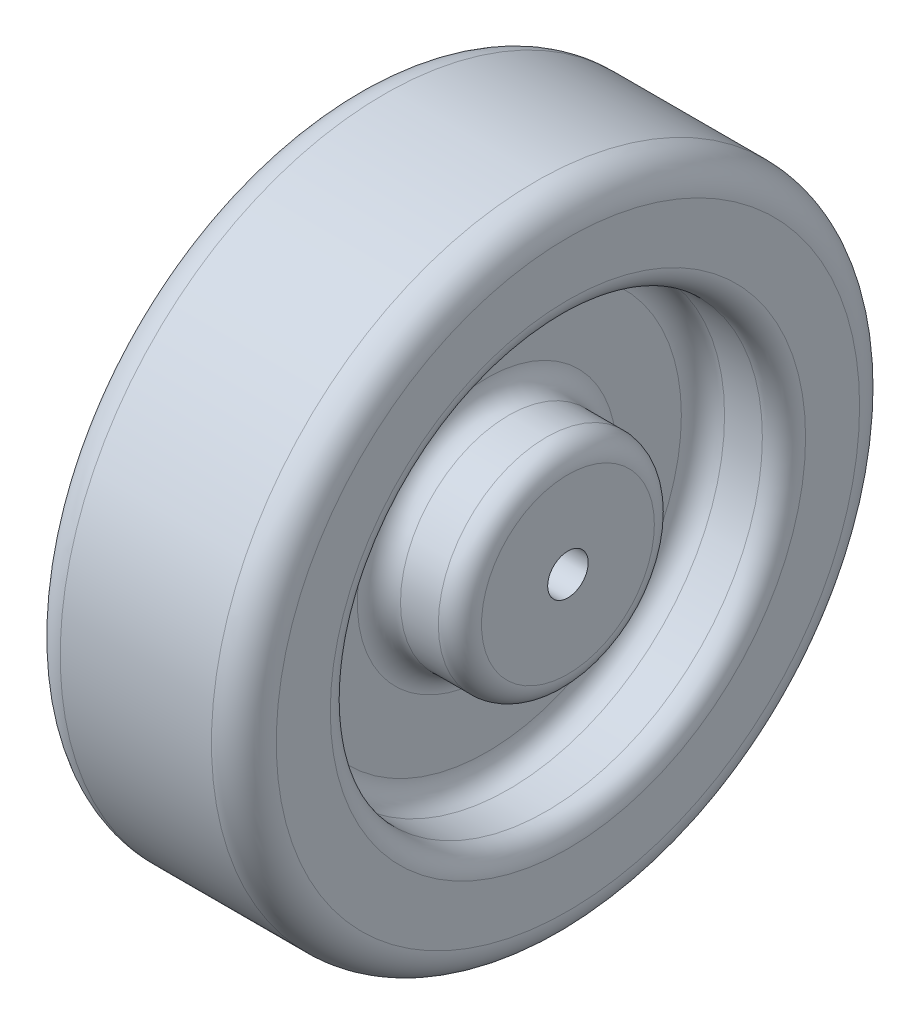
ISO-10303-21;
HEADER;
FILE_DESCRIPTION(('STEP AP214'),'2;1');
FILE_NAME('part.step','',(''),(''),'','','');
FILE_SCHEMA(('AUTOMOTIVE_DESIGN { 1 0 10303 214 1 1 1 1 }'));
ENDSEC;
DATA;
#1=APPLICATION_CONTEXT('core data for automotive mechanical design processes');
#2=APPLICATION_PROTOCOL_DEFINITION('international standard','automotive_design',2000,#1);
#3=PRODUCT_CONTEXT('',#1,'mechanical');
#4=PRODUCT('Part','Part','',(#3));
#5=PRODUCT_RELATED_PRODUCT_CATEGORY('part','',(#4));
#6=PRODUCT_DEFINITION_FORMATION('','',#4);
#7=PRODUCT_DEFINITION_CONTEXT('part definition',#1,'design');
#8=PRODUCT_DEFINITION('design','',#6,#7);
#9=PRODUCT_DEFINITION_SHAPE('','',#8);
#10=(LENGTH_UNIT() NAMED_UNIT(*) SI_UNIT(.MILLI.,.METRE.));
#11=(NAMED_UNIT(*) PLANE_ANGLE_UNIT() SI_UNIT($,.RADIAN.));
#12=(NAMED_UNIT(*) SI_UNIT($,.STERADIAN.) SOLID_ANGLE_UNIT());
#13=UNCERTAINTY_MEASURE_WITH_UNIT(LENGTH_MEASURE(1.E-05),#10,'distance_accuracy_value','');
#14=(GEOMETRIC_REPRESENTATION_CONTEXT(3) GLOBAL_UNCERTAINTY_ASSIGNED_CONTEXT((#13)) GLOBAL_UNIT_ASSIGNED_CONTEXT((#10,
#11,#12)) REPRESENTATION_CONTEXT('',''));
#15=CARTESIAN_POINT('',(0.,0.,0.));
#16=DIRECTION('',(0.,0.,1.));
#17=DIRECTION('',(1.,0.,0.));
#18=AXIS2_PLACEMENT_3D('',#15,#16,#17);
#19=CARTESIAN_POINT('',(50.8,0.,0.));
#20=DIRECTION('',(-1.,0.,0.));
#21=DIRECTION('',(0.,0.,1.));
#22=AXIS2_PLACEMENT_3D('',#19,#20,#21);
#23=CYLINDRICAL_SURFACE('',#22,76.2);
#24=CARTESIAN_POINT('',(7.62,0.,0.));
#25=DIRECTION('',(1.,0.,0.));
#26=DIRECTION('',(0.,0.,-1.));
#27=AXIS2_PLACEMENT_3D('',#24,#25,#26);
#28=CIRCLE('',#27,76.2);
#29=CARTESIAN_POINT('',(7.62,0.,-76.2));
#30=VERTEX_POINT('',#29);
#31=EDGE_CURVE('E94',#30,#30,#28,.T.);
#32=ORIENTED_EDGE('',*,*,#31,.T.);
#33=EDGE_LOOP('',(#32));
#34=FACE_BOUND('',#33,.T.);
#35=CARTESIAN_POINT('',(43.18,0.,0.));
#36=DIRECTION('',(1.,0.,0.));
#37=DIRECTION('',(0.,0.,-1.));
#38=AXIS2_PLACEMENT_3D('',#35,#36,#37);
#39=CIRCLE('',#38,76.2);
#40=CARTESIAN_POINT('',(43.18,0.,-76.2));
#41=VERTEX_POINT('',#40);
#42=EDGE_CURVE('E97',#41,#41,#39,.F.);
#43=ORIENTED_EDGE('',*,*,#42,.T.);
#44=EDGE_LOOP('',(#43));
#45=FACE_BOUND('',#44,.T.);
#46=ADVANCED_FACE('F32',(#34,#45),#23,.T.);
#47=CARTESIAN_POINT('',(50.8,0.,0.));
#48=DIRECTION('',(1.,0.,0.));
#49=DIRECTION('',(0.,0.,-1.));
#50=AXIS2_PLACEMENT_3D('',#47,#48,#49);
#51=PLANE('',#50);
#52=CARTESIAN_POINT('',(50.8,0.,0.));
#53=DIRECTION('',(1.,0.,0.));
#54=DIRECTION('',(0.,0.,-1.));
#55=AXIS2_PLACEMENT_3D('',#52,#53,#54);
#56=CIRCLE('',#55,55.88);
#57=CARTESIAN_POINT('',(50.8,0.,-55.88));
#58=VERTEX_POINT('',#57);
#59=EDGE_CURVE('E39',#58,#58,#56,.F.);
#60=ORIENTED_EDGE('',*,*,#59,.T.);
#61=EDGE_LOOP('',(#60));
#62=FACE_BOUND('',#61,.T.);
#63=CARTESIAN_POINT('',(50.8,0.,0.));
#64=DIRECTION('',(1.,0.,0.));
#65=DIRECTION('',(0.,0.,-1.));
#66=AXIS2_PLACEMENT_3D('',#63,#64,#65);
#67=CIRCLE('',#66,68.58);
#68=CARTESIAN_POINT('',(50.8,0.,-68.58));
#69=VERTEX_POINT('',#68);
#70=EDGE_CURVE('E88',#69,#69,#67,.T.);
#71=ORIENTED_EDGE('',*,*,#70,.T.);
#72=EDGE_LOOP('',(#71));
#73=FACE_BOUND('',#72,.T.);
#74=ADVANCED_FACE('F132',(#62,#73),#51,.T.);
#75=CARTESIAN_POINT('',(0.,0.,0.));
#76=DIRECTION('',(1.,0.,0.));
#77=DIRECTION('',(0.,0.,-1.));
#78=AXIS2_PLACEMENT_3D('',#75,#76,#77);
#79=PLANE('',#78);
#80=CARTESIAN_POINT('',(0.,0.,0.));
#81=DIRECTION('',(1.,0.,0.));
#82=DIRECTION('',(0.,0.,-1.));
#83=AXIS2_PLACEMENT_3D('',#80,#81,#82);
#84=CIRCLE('',#83,55.88);
#85=CARTESIAN_POINT('',(0.,0.,-55.88));
#86=VERTEX_POINT('',#85);
#87=EDGE_CURVE('E67',#86,#86,#84,.T.);
#88=ORIENTED_EDGE('',*,*,#87,.T.);
#89=EDGE_LOOP('',(#88));
#90=FACE_BOUND('',#89,.T.);
#91=CARTESIAN_POINT('',(0.,0.,0.));
#92=DIRECTION('',(1.,0.,0.));
#93=DIRECTION('',(0.,0.,-1.));
#94=AXIS2_PLACEMENT_3D('',#91,#92,#93);
#95=CIRCLE('',#94,68.58);
#96=CARTESIAN_POINT('',(0.,0.,-68.58));
#97=VERTEX_POINT('',#96);
#98=EDGE_CURVE('E91',#97,#97,#95,.F.);
#99=ORIENTED_EDGE('',*,*,#98,.T.);
#100=EDGE_LOOP('',(#99));
#101=FACE_BOUND('',#100,.T.);
#102=ADVANCED_FACE('F121',(#90,#101),#79,.F.);
#103=CARTESIAN_POINT('',(31.75,0.,0.));
#104=DIRECTION('',(1.,0.,0.));
#105=DIRECTION('',(0.,0.,-1.));
#106=AXIS2_PLACEMENT_3D('',#103,#104,#105);
#107=CYLINDRICAL_SURFACE('',#106,50.8);
#108=CARTESIAN_POINT('',(36.83,0.,0.));
#109=DIRECTION('',(1.,0.,0.));
#110=DIRECTION('',(0.,0.,-1.));
#111=AXIS2_PLACEMENT_3D('',#108,#109,#110);
#112=CIRCLE('',#111,50.8);
#113=CARTESIAN_POINT('',(36.83,0.,-50.8));
#114=VERTEX_POINT('',#113);
#115=EDGE_CURVE('E43',#114,#114,#112,.F.);
#116=ORIENTED_EDGE('',*,*,#115,.T.);
#117=EDGE_LOOP('',(#116));
#118=FACE_BOUND('',#117,.T.);
#119=CARTESIAN_POINT('',(45.72,0.,0.));
#120=DIRECTION('',(1.,0.,0.));
#121=DIRECTION('',(0.,0.,-1.));
#122=AXIS2_PLACEMENT_3D('',#119,#120,#121);
#123=CIRCLE('',#122,50.8);
#124=CARTESIAN_POINT('',(45.72,0.,-50.8));
#125=VERTEX_POINT('',#124);
#126=EDGE_CURVE('E47',#125,#125,#123,.T.);
#127=ORIENTED_EDGE('',*,*,#126,.T.);
#128=EDGE_LOOP('',(#127));
#129=FACE_BOUND('',#128,.T.);
#130=ADVANCED_FACE('F131',(#118,#129),#107,.F.);
#131=CARTESIAN_POINT('',(31.75,0.,0.));
#132=DIRECTION('',(1.,0.,0.));
#133=DIRECTION('',(0.,0.,-1.));
#134=AXIS2_PLACEMENT_3D('',#131,#132,#133);
#135=PLANE('',#134);
#136=CARTESIAN_POINT('',(31.75,0.,0.));
#137=DIRECTION('',(1.,0.,0.));
#138=DIRECTION('',(0.,0.,-1.));
#139=AXIS2_PLACEMENT_3D('',#136,#137,#138);
#140=CIRCLE('',#139,30.48);
#141=CARTESIAN_POINT('',(31.75,0.,-30.48));
#142=VERTEX_POINT('',#141);
#143=EDGE_CURVE('E52',#142,#142,#140,.F.);
#144=ORIENTED_EDGE('',*,*,#143,.T.);
#145=EDGE_LOOP('',(#144));
#146=FACE_BOUND('',#145,.T.);
#147=CARTESIAN_POINT('',(31.75,0.,0.));
#148=DIRECTION('',(1.,0.,0.));
#149=DIRECTION('',(0.,0.,-1.));
#150=AXIS2_PLACEMENT_3D('',#147,#148,#149);
#151=CIRCLE('',#150,45.72);
#152=CARTESIAN_POINT('',(31.75,0.,-45.72));
#153=VERTEX_POINT('',#152);
#154=EDGE_CURVE('E55',#153,#153,#151,.T.);
#155=ORIENTED_EDGE('',*,*,#154,.T.);
#156=EDGE_LOOP('',(#155));
#157=FACE_BOUND('',#156,.T.);
#158=ADVANCED_FACE('F182',(#146,#157),#135,.T.);
#159=CARTESIAN_POINT('',(31.75,0.,0.));
#160=DIRECTION('',(1.,0.,0.));
#161=DIRECTION('',(0.,0.,-1.));
#162=AXIS2_PLACEMENT_3D('',#159,#160,#161);
#163=CYLINDRICAL_SURFACE('',#162,25.4);
#164=CARTESIAN_POINT('',(36.83,0.,0.));
#165=DIRECTION('',(1.,0.,0.));
#166=DIRECTION('',(0.,0.,-1.));
#167=AXIS2_PLACEMENT_3D('',#164,#165,#166);
#168=CIRCLE('',#167,25.4);
#169=CARTESIAN_POINT('',(36.83,0.,-25.4));
#170=VERTEX_POINT('',#169);
#171=EDGE_CURVE('E58',#170,#170,#168,.T.);
#172=ORIENTED_EDGE('',*,*,#171,.T.);
#173=EDGE_LOOP('',(#172));
#174=FACE_BOUND('',#173,.T.);
#175=CARTESIAN_POINT('',(45.72,0.,0.));
#176=DIRECTION('',(1.,0.,0.));
#177=DIRECTION('',(0.,0.,-1.));
#178=AXIS2_PLACEMENT_3D('',#175,#176,#177);
#179=CIRCLE('',#178,25.4);
#180=CARTESIAN_POINT('',(45.72,0.,-25.4));
#181=VERTEX_POINT('',#180);
#182=EDGE_CURVE('E61',#181,#181,#179,.F.);
#183=ORIENTED_EDGE('',*,*,#182,.T.);
#184=EDGE_LOOP('',(#183));
#185=FACE_BOUND('',#184,.T.);
#186=ADVANCED_FACE('F188',(#174,#185),#163,.T.);
#187=CARTESIAN_POINT('',(50.8,0.,0.));
#188=DIRECTION('',(1.,0.,0.));
#189=DIRECTION('',(0.,0.,-1.));
#190=AXIS2_PLACEMENT_3D('',#187,#188,#189);
#191=CIRCLE('',#190,20.32);
#192=CARTESIAN_POINT('',(50.8,0.,-20.32));
#193=VERTEX_POINT('',#192);
#194=EDGE_CURVE('E10',#193,#193,#191,.T.);
#195=ORIENTED_EDGE('',*,*,#194,.T.);
#196=EDGE_LOOP('',(#195));
#197=FACE_BOUND('',#196,.T.);
#198=CARTESIAN_POINT('',(50.8,0.,0.));
#199=DIRECTION('',(-1.,0.,0.));
#200=DIRECTION('',(0.,0.,1.));
#201=AXIS2_PLACEMENT_3D('',#198,#199,#200);
#202=CIRCLE('',#201,4.7625);
#203=CARTESIAN_POINT('',(50.8,0.,4.7625));
#204=VERTEX_POINT('',#203);
#205=EDGE_CURVE('E100',#204,#204,#202,.T.);
#206=ORIENTED_EDGE('',*,*,#205,.T.);
#207=EDGE_LOOP('',(#206));
#208=FACE_BOUND('',#207,.T.);
#209=ADVANCED_FACE('F107',(#197,#208),#51,.T.);
#210=CARTESIAN_POINT('',(19.05,0.,0.));
#211=DIRECTION('',(-1.,0.,0.));
#212=DIRECTION('',(0.,0.,1.));
#213=AXIS2_PLACEMENT_3D('',#210,#211,#212);
#214=CYLINDRICAL_SURFACE('',#213,50.8);
#215=CARTESIAN_POINT('',(5.08,0.,0.));
#216=DIRECTION('',(1.,0.,0.));
#217=DIRECTION('',(0.,0.,-1.));
#218=AXIS2_PLACEMENT_3D('',#215,#216,#217);
#219=CIRCLE('',#218,50.8);
#220=CARTESIAN_POINT('',(5.08,0.,-50.8));
#221=VERTEX_POINT('',#220);
#222=EDGE_CURVE('E70',#221,#221,#219,.F.);
#223=ORIENTED_EDGE('',*,*,#222,.T.);
#224=EDGE_LOOP('',(#223));
#225=FACE_BOUND('',#224,.T.);
#226=CARTESIAN_POINT('',(13.97,0.,0.));
#227=DIRECTION('',(-1.,0.,0.));
#228=DIRECTION('',(0.,0.,1.));
#229=AXIS2_PLACEMENT_3D('',#226,#227,#228);
#230=CIRCLE('',#229,50.8);
#231=CARTESIAN_POINT('',(13.97,0.,50.8));
#232=VERTEX_POINT('',#231);
#233=EDGE_CURVE('E73',#232,#232,#230,.F.);
#234=ORIENTED_EDGE('',*,*,#233,.T.);
#235=EDGE_LOOP('',(#234));
#236=FACE_BOUND('',#235,.T.);
#237=ADVANCED_FACE('F195',(#225,#236),#214,.F.);
#238=CARTESIAN_POINT('',(19.05,0.,0.));
#239=DIRECTION('',(-1.,0.,0.));
#240=DIRECTION('',(0.,0.,1.));
#241=AXIS2_PLACEMENT_3D('',#238,#239,#240);
#242=PLANE('',#241);
#243=CARTESIAN_POINT('',(19.05,0.,0.));
#244=DIRECTION('',(-1.,0.,0.));
#245=DIRECTION('',(0.,0.,1.));
#246=AXIS2_PLACEMENT_3D('',#243,#244,#245);
#247=CIRCLE('',#246,30.48);
#248=CARTESIAN_POINT('',(19.05,0.,30.48));
#249=VERTEX_POINT('',#248);
#250=EDGE_CURVE('E76',#249,#249,#247,.F.);
#251=ORIENTED_EDGE('',*,*,#250,.T.);
#252=EDGE_LOOP('',(#251));
#253=FACE_BOUND('',#252,.T.);
#254=CARTESIAN_POINT('',(19.05,0.,0.));
#255=DIRECTION('',(-1.,0.,0.));
#256=DIRECTION('',(0.,0.,1.));
#257=AXIS2_PLACEMENT_3D('',#254,#255,#256);
#258=CIRCLE('',#257,45.72);
#259=CARTESIAN_POINT('',(19.05,0.,45.72));
#260=VERTEX_POINT('',#259);
#261=EDGE_CURVE('E79',#260,#260,#258,.T.);
#262=ORIENTED_EDGE('',*,*,#261,.T.);
#263=EDGE_LOOP('',(#262));
#264=FACE_BOUND('',#263,.T.);
#265=ADVANCED_FACE('F125',(#253,#264),#242,.T.);
#266=CARTESIAN_POINT('',(19.05,0.,0.));
#267=DIRECTION('',(-1.,0.,0.));
#268=DIRECTION('',(0.,0.,1.));
#269=AXIS2_PLACEMENT_3D('',#266,#267,#268);
#270=CYLINDRICAL_SURFACE('',#269,25.4);
#271=CARTESIAN_POINT('',(13.97,0.,0.));
#272=DIRECTION('',(-1.,0.,0.));
#273=DIRECTION('',(0.,0.,1.));
#274=AXIS2_PLACEMENT_3D('',#271,#272,#273);
#275=CIRCLE('',#274,25.4);
#276=CARTESIAN_POINT('',(13.97,0.,25.4));
#277=VERTEX_POINT('',#276);
#278=EDGE_CURVE('E82',#277,#277,#275,.T.);
#279=ORIENTED_EDGE('',*,*,#278,.T.);
#280=EDGE_LOOP('',(#279));
#281=FACE_BOUND('',#280,.T.);
#282=CARTESIAN_POINT('',(5.08,0.,0.));
#283=DIRECTION('',(1.,0.,0.));
#284=DIRECTION('',(0.,0.,-1.));
#285=AXIS2_PLACEMENT_3D('',#282,#283,#284);
#286=CIRCLE('',#285,25.4);
#287=CARTESIAN_POINT('',(5.08,0.,-25.4));
#288=VERTEX_POINT('',#287);
#289=EDGE_CURVE('E85',#288,#288,#286,.T.);
#290=ORIENTED_EDGE('',*,*,#289,.T.);
#291=EDGE_LOOP('',(#290));
#292=FACE_BOUND('',#291,.T.);
#293=ADVANCED_FACE('F118',(#281,#292),#270,.T.);
#294=CARTESIAN_POINT('',(0.,0.,0.));
#295=DIRECTION('',(1.,0.,0.));
#296=DIRECTION('',(0.,0.,-1.));
#297=AXIS2_PLACEMENT_3D('',#294,#295,#296);
#298=CIRCLE('',#297,20.32);
#299=CARTESIAN_POINT('',(0.,0.,-20.32));
#300=VERTEX_POINT('',#299);
#301=EDGE_CURVE('E64',#300,#300,#298,.F.);
#302=ORIENTED_EDGE('',*,*,#301,.T.);
#303=EDGE_LOOP('',(#302));
#304=FACE_BOUND('',#303,.T.);
#305=CARTESIAN_POINT('',(0.,0.,0.));
#306=DIRECTION('',(-1.,0.,0.));
#307=DIRECTION('',(0.,0.,1.));
#308=AXIS2_PLACEMENT_3D('',#305,#306,#307);
#309=CIRCLE('',#308,4.7625);
#310=CARTESIAN_POINT('',(0.,0.,4.7625));
#311=VERTEX_POINT('',#310);
#312=EDGE_CURVE('E101',#311,#311,#309,.T.);
#313=ORIENTED_EDGE('',*,*,#312,.F.);
#314=EDGE_LOOP('',(#313));
#315=FACE_BOUND('',#314,.T.);
#316=ADVANCED_FACE('F113',(#304,#315),#79,.F.);
#317=CARTESIAN_POINT('',(50.8,0.,0.));
#318=DIRECTION('',(-1.,0.,0.));
#319=DIRECTION('',(0.,0.,1.));
#320=AXIS2_PLACEMENT_3D('',#317,#318,#319);
#321=CYLINDRICAL_SURFACE('',#320,4.7625);
#322=ORIENTED_EDGE('',*,*,#205,.F.);
#323=EDGE_LOOP('',(#322));
#324=FACE_BOUND('',#323,.T.);
#325=ORIENTED_EDGE('',*,*,#312,.T.);
#326=EDGE_LOOP('',(#325));
#327=FACE_BOUND('',#326,.T.);
#328=ADVANCED_FACE('F109',(#324,#327),#321,.F.);
#329=CARTESIAN_POINT('',(7.62,0.,0.));
#330=DIRECTION('',(1.,0.,0.));
#331=DIRECTION('',(0.,0.,-1.));
#332=AXIS2_PLACEMENT_3D('',#329,#330,#331);
#333=TOROIDAL_SURFACE('',#332,68.58,7.62);
#334=ORIENTED_EDGE('',*,*,#98,.F.);
#335=EDGE_LOOP('',(#334));
#336=FACE_BOUND('',#335,.T.);
#337=ORIENTED_EDGE('',*,*,#31,.F.);
#338=EDGE_LOOP('',(#337));
#339=FACE_BOUND('',#338,.T.);
#340=ADVANCED_FACE('F112',(#336,#339),#333,.T.);
#341=CARTESIAN_POINT('',(43.18,0.,0.));
#342=DIRECTION('',(1.,0.,0.));
#343=DIRECTION('',(0.,0.,-1.));
#344=AXIS2_PLACEMENT_3D('',#341,#342,#343);
#345=TOROIDAL_SURFACE('',#344,68.58,7.62);
#346=ORIENTED_EDGE('',*,*,#42,.F.);
#347=EDGE_LOOP('',(#346));
#348=FACE_BOUND('',#347,.T.);
#349=ORIENTED_EDGE('',*,*,#70,.F.);
#350=EDGE_LOOP('',(#349));
#351=FACE_BOUND('',#350,.T.);
#352=ADVANCED_FACE('F143',(#348,#351),#345,.T.);
#353=CARTESIAN_POINT('',(13.97,0.,0.));
#354=DIRECTION('',(-1.,0.,0.));
#355=DIRECTION('',(0.,0.,1.));
#356=AXIS2_PLACEMENT_3D('',#353,#354,#355);
#357=TOROIDAL_SURFACE('',#356,30.48,5.08);
#358=ORIENTED_EDGE('',*,*,#250,.F.);
#359=EDGE_LOOP('',(#358));
#360=FACE_BOUND('',#359,.T.);
#361=ORIENTED_EDGE('',*,*,#278,.F.);
#362=EDGE_LOOP('',(#361));
#363=FACE_BOUND('',#362,.T.);
#364=ADVANCED_FACE('F147',(#360,#363),#357,.F.);
#365=CARTESIAN_POINT('',(5.08,0.,0.));
#366=DIRECTION('',(1.,0.,0.));
#367=DIRECTION('',(0.,0.,-1.));
#368=AXIS2_PLACEMENT_3D('',#365,#366,#367);
#369=TOROIDAL_SURFACE('',#368,55.88,5.08);
#370=ORIENTED_EDGE('',*,*,#87,.F.);
#371=EDGE_LOOP('',(#370));
#372=FACE_BOUND('',#371,.T.);
#373=ORIENTED_EDGE('',*,*,#222,.F.);
#374=EDGE_LOOP('',(#373));
#375=FACE_BOUND('',#374,.T.);
#376=ADVANCED_FACE('F151',(#372,#375),#369,.T.);
#377=CARTESIAN_POINT('',(13.97,0.,0.));
#378=DIRECTION('',(-1.,0.,0.));
#379=DIRECTION('',(0.,0.,1.));
#380=AXIS2_PLACEMENT_3D('',#377,#378,#379);
#381=TOROIDAL_SURFACE('',#380,45.72,5.08);
#382=ORIENTED_EDGE('',*,*,#233,.F.);
#383=EDGE_LOOP('',(#382));
#384=FACE_BOUND('',#383,.T.);
#385=ORIENTED_EDGE('',*,*,#261,.F.);
#386=EDGE_LOOP('',(#385));
#387=FACE_BOUND('',#386,.T.);
#388=ADVANCED_FACE('F155',(#384,#387),#381,.F.);
#389=CARTESIAN_POINT('',(5.08,0.,0.));
#390=DIRECTION('',(1.,0.,0.));
#391=DIRECTION('',(0.,0.,-1.));
#392=AXIS2_PLACEMENT_3D('',#389,#390,#391);
#393=TOROIDAL_SURFACE('',#392,20.32,5.08);
#394=ORIENTED_EDGE('',*,*,#289,.F.);
#395=EDGE_LOOP('',(#394));
#396=FACE_BOUND('',#395,.T.);
#397=ORIENTED_EDGE('',*,*,#301,.F.);
#398=EDGE_LOOP('',(#397));
#399=FACE_BOUND('',#398,.T.);
#400=ADVANCED_FACE('F159',(#396,#399),#393,.T.);
#401=CARTESIAN_POINT('',(36.83,0.,0.));
#402=DIRECTION('',(1.,0.,0.));
#403=DIRECTION('',(0.,0.,-1.));
#404=AXIS2_PLACEMENT_3D('',#401,#402,#403);
#405=TOROIDAL_SURFACE('',#404,30.48,5.08);
#406=ORIENTED_EDGE('',*,*,#143,.F.);
#407=EDGE_LOOP('',(#406));
#408=FACE_BOUND('',#407,.T.);
#409=ORIENTED_EDGE('',*,*,#171,.F.);
#410=EDGE_LOOP('',(#409));
#411=FACE_BOUND('',#410,.T.);
#412=ADVANCED_FACE('F163',(#408,#411),#405,.F.);
#413=CARTESIAN_POINT('',(36.83,0.,0.));
#414=DIRECTION('',(1.,0.,0.));
#415=DIRECTION('',(0.,0.,-1.));
#416=AXIS2_PLACEMENT_3D('',#413,#414,#415);
#417=TOROIDAL_SURFACE('',#416,45.72,5.08);
#418=ORIENTED_EDGE('',*,*,#115,.F.);
#419=EDGE_LOOP('',(#418));
#420=FACE_BOUND('',#419,.T.);
#421=ORIENTED_EDGE('',*,*,#154,.F.);
#422=EDGE_LOOP('',(#421));
#423=FACE_BOUND('',#422,.T.);
#424=ADVANCED_FACE('F167',(#420,#423),#417,.F.);
#425=CARTESIAN_POINT('',(45.72,0.,0.));
#426=DIRECTION('',(1.,0.,0.));
#427=DIRECTION('',(0.,0.,-1.));
#428=AXIS2_PLACEMENT_3D('',#425,#426,#427);
#429=TOROIDAL_SURFACE('',#428,55.88,5.08);
#430=ORIENTED_EDGE('',*,*,#59,.F.);
#431=EDGE_LOOP('',(#430));
#432=FACE_BOUND('',#431,.T.);
#433=ORIENTED_EDGE('',*,*,#126,.F.);
#434=EDGE_LOOP('',(#433));
#435=FACE_BOUND('',#434,.T.);
#436=ADVANCED_FACE('F170',(#432,#435),#429,.T.);
#437=CARTESIAN_POINT('',(45.72,0.,0.));
#438=DIRECTION('',(1.,0.,0.));
#439=DIRECTION('',(0.,0.,-1.));
#440=AXIS2_PLACEMENT_3D('',#437,#438,#439);
#441=TOROIDAL_SURFACE('',#440,20.32,5.08);
#442=ORIENTED_EDGE('',*,*,#182,.F.);
#443=EDGE_LOOP('',(#442));
#444=FACE_BOUND('',#443,.T.);
#445=ORIENTED_EDGE('',*,*,#194,.F.);
#446=EDGE_LOOP('',(#445));
#447=FACE_BOUND('',#446,.T.);
#448=ADVANCED_FACE('F34',(#444,#447),#441,.T.);
#449=CLOSED_SHELL('',(#46,#74,#102,#130,#158,#186,#209,#237,#265,#293,#316,#328,#340,#352,#364,
#376,#388,#400,#412,#424,#436,#448));
#450=MANIFOLD_SOLID_BREP('B2',#449);
#451=ADVANCED_BREP_SHAPE_REPRESENTATION('',(#18,#450),#14);
#452=SHAPE_DEFINITION_REPRESENTATION(#9,#451);
ENDSEC;
END-ISO-10303-21;
